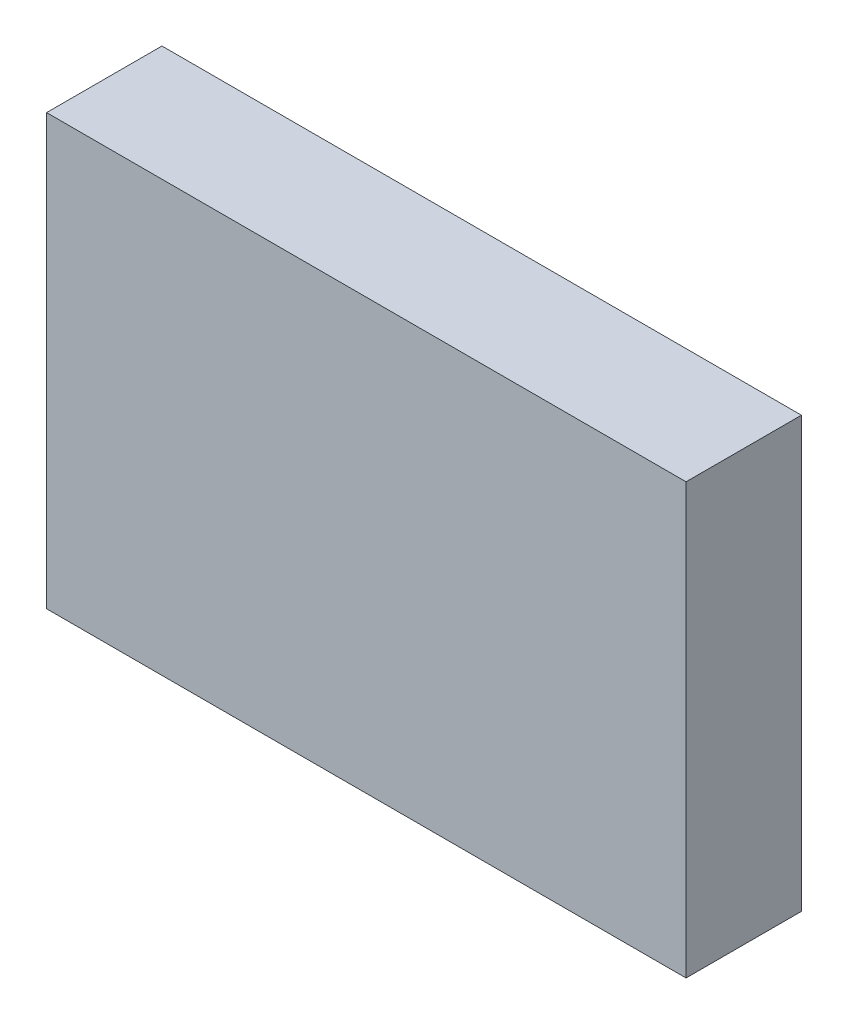
ISO-10303-21;
HEADER;
FILE_DESCRIPTION(('STEP AP214'),'2;1');
FILE_NAME('part.step','',(''),(''),'','','');
FILE_SCHEMA(('AUTOMOTIVE_DESIGN { 1 0 10303 214 1 1 1 1 }'));
ENDSEC;
DATA;
#1=APPLICATION_CONTEXT('core data for automotive mechanical design processes');
#2=APPLICATION_PROTOCOL_DEFINITION('international standard','automotive_design',2000,#1);
#3=PRODUCT_CONTEXT('',#1,'mechanical');
#4=PRODUCT('Part','Part','',(#3));
#5=PRODUCT_RELATED_PRODUCT_CATEGORY('part','',(#4));
#6=PRODUCT_DEFINITION_FORMATION('','',#4);
#7=PRODUCT_DEFINITION_CONTEXT('part definition',#1,'design');
#8=PRODUCT_DEFINITION('design','',#6,#7);
#9=PRODUCT_DEFINITION_SHAPE('','',#8);
#10=(LENGTH_UNIT() NAMED_UNIT(*) SI_UNIT(.MILLI.,.METRE.));
#11=(NAMED_UNIT(*) PLANE_ANGLE_UNIT() SI_UNIT($,.RADIAN.));
#12=(NAMED_UNIT(*) SI_UNIT($,.STERADIAN.) SOLID_ANGLE_UNIT());
#13=UNCERTAINTY_MEASURE_WITH_UNIT(LENGTH_MEASURE(1.E-05),#10,'distance_accuracy_value','');
#14=(GEOMETRIC_REPRESENTATION_CONTEXT(3) GLOBAL_UNCERTAINTY_ASSIGNED_CONTEXT((#13)) GLOBAL_UNIT_ASSIGNED_CONTEXT((#10,
#11,#12)) REPRESENTATION_CONTEXT('',''));
#15=CARTESIAN_POINT('',(0.,0.,0.));
#16=DIRECTION('',(0.,0.,1.));
#17=DIRECTION('',(1.,0.,0.));
#18=AXIS2_PLACEMENT_3D('',#15,#16,#17);
#19=CARTESIAN_POINT('',(-1.52449276,-1.02449122,0.5499989));
#20=DIRECTION('',(0.,0.,1.));
#21=DIRECTION('',(1.,0.,0.));
#22=AXIS2_PLACEMENT_3D('',#19,#20,#21);
#23=PLANE('',#22);
#24=DIRECTION('',(1.,0.,0.));
#25=VECTOR('',#24,1.);
#26=CARTESIAN_POINT('',(-1.52449276,1.02449122,0.5499989));
#27=LINE('',#26,#25);
#28=CARTESIAN_POINT('',(-1.52449276,1.02449122,0.5499989));
#29=VERTEX_POINT('',#28);
#30=CARTESIAN_POINT('',(1.52449276,1.02449122,0.5499989));
#31=VERTEX_POINT('',#30);
#32=EDGE_CURVE('E53',#29,#31,#27,.T.);
#33=ORIENTED_EDGE('',*,*,#32,.F.);
#34=DIRECTION('',(0.,1.,0.));
#35=VECTOR('',#34,1.);
#36=CARTESIAN_POINT('',(-1.52449276,-1.02449122,0.5499989));
#37=LINE('',#36,#35);
#38=CARTESIAN_POINT('',(-1.52449276,-1.02449122,0.5499989));
#39=VERTEX_POINT('',#38);
#40=EDGE_CURVE('E68',#39,#29,#37,.T.);
#41=ORIENTED_EDGE('',*,*,#40,.F.);
#42=DIRECTION('',(1.,0.,0.));
#43=VECTOR('',#42,1.);
#44=CARTESIAN_POINT('',(1.52449276,-1.02449122,0.5499989));
#45=LINE('',#44,#43);
#46=CARTESIAN_POINT('',(1.52449276,-1.02449122,0.5499989));
#47=VERTEX_POINT('',#46);
#48=EDGE_CURVE('E20',#47,#39,#45,.F.);
#49=ORIENTED_EDGE('',*,*,#48,.F.);
#50=DIRECTION('',(0.,1.,0.));
#51=VECTOR('',#50,1.);
#52=CARTESIAN_POINT('',(1.52449276,1.02449122,0.5499989));
#53=LINE('',#52,#51);
#54=EDGE_CURVE('E58',#31,#47,#53,.F.);
#55=ORIENTED_EDGE('',*,*,#54,.F.);
#56=EDGE_LOOP('',(#33,#41,#49,#55));
#57=FACE_BOUND('',#56,.T.);
#58=ADVANCED_FACE('F17',(#57),#23,.T.);
#59=CARTESIAN_POINT('',(1.52449276,-1.02449122,0.));
#60=DIRECTION('',(0.,-1.,0.));
#61=DIRECTION('',(0.,0.,-1.));
#62=AXIS2_PLACEMENT_3D('',#59,#60,#61);
#63=PLANE('',#62);
#64=DIRECTION('',(0.,0.,1.));
#65=VECTOR('',#64,1.);
#66=CARTESIAN_POINT('',(-1.52449276,-1.02449122,0.));
#67=LINE('',#66,#65);
#68=CARTESIAN_POINT('',(-1.52449276,-1.02449122,0.));
#69=VERTEX_POINT('',#68);
#70=EDGE_CURVE('E79',#69,#39,#67,.T.);
#71=ORIENTED_EDGE('',*,*,#70,.F.);
#72=DIRECTION('',(1.,0.,0.));
#73=VECTOR('',#72,1.);
#74=CARTESIAN_POINT('',(-1.52449276,-1.02449122,0.));
#75=LINE('',#74,#73);
#76=CARTESIAN_POINT('',(1.52449276,-1.02449122,0.));
#77=VERTEX_POINT('',#76);
#78=EDGE_CURVE('E74',#69,#77,#75,.T.);
#79=ORIENTED_EDGE('',*,*,#78,.T.);
#80=DIRECTION('',(0.,0.,-1.));
#81=VECTOR('',#80,1.);
#82=CARTESIAN_POINT('',(1.52449276,-1.02449122,0.));
#83=LINE('',#82,#81);
#84=EDGE_CURVE('E63',#47,#77,#83,.T.);
#85=ORIENTED_EDGE('',*,*,#84,.F.);
#86=ORIENTED_EDGE('',*,*,#48,.T.);
#87=EDGE_LOOP('',(#71,#79,#85,#86));
#88=FACE_BOUND('',#87,.T.);
#89=ADVANCED_FACE('F73',(#88),#63,.T.);
#90=CARTESIAN_POINT('',(1.52449276,1.02449122,0.));
#91=DIRECTION('',(1.,0.,0.));
#92=DIRECTION('',(0.,0.,-1.));
#93=AXIS2_PLACEMENT_3D('',#90,#91,#92);
#94=PLANE('',#93);
#95=ORIENTED_EDGE('',*,*,#84,.T.);
#96=DIRECTION('',(0.,1.,0.));
#97=VECTOR('',#96,1.);
#98=CARTESIAN_POINT('',(1.52449276,-1.02449122,0.));
#99=LINE('',#98,#97);
#100=CARTESIAN_POINT('',(1.52449276,1.02449122,0.));
#101=VERTEX_POINT('',#100);
#102=EDGE_CURVE('E84',#77,#101,#99,.T.);
#103=ORIENTED_EDGE('',*,*,#102,.T.);
#104=DIRECTION('',(0.,0.,1.));
#105=VECTOR('',#104,1.);
#106=CARTESIAN_POINT('',(1.52449276,1.02449122,0.));
#107=LINE('',#106,#105);
#108=EDGE_CURVE('E65',#31,#101,#107,.F.);
#109=ORIENTED_EDGE('',*,*,#108,.F.);
#110=ORIENTED_EDGE('',*,*,#54,.T.);
#111=EDGE_LOOP('',(#95,#103,#109,#110));
#112=FACE_BOUND('',#111,.T.);
#113=ADVANCED_FACE('F60',(#112),#94,.T.);
#114=CARTESIAN_POINT('',(-1.52449276,1.02449122,0.));
#115=DIRECTION('',(0.,1.,0.));
#116=DIRECTION('',(0.,0.,1.));
#117=AXIS2_PLACEMENT_3D('',#114,#115,#116);
#118=PLANE('',#117);
#119=ORIENTED_EDGE('',*,*,#108,.T.);
#120=DIRECTION('',(1.,0.,0.));
#121=VECTOR('',#120,1.);
#122=CARTESIAN_POINT('',(-1.52449276,1.02449122,0.));
#123=LINE('',#122,#121);
#124=CARTESIAN_POINT('',(-1.52449276,1.02449122,0.));
#125=VERTEX_POINT('',#124);
#126=EDGE_CURVE('E26',#101,#125,#123,.F.);
#127=ORIENTED_EDGE('',*,*,#126,.T.);
#128=DIRECTION('',(0.,0.,1.));
#129=VECTOR('',#128,1.);
#130=CARTESIAN_POINT('',(-1.52449276,1.02449122,0.));
#131=LINE('',#130,#129);
#132=EDGE_CURVE('E34',#29,#125,#131,.F.);
#133=ORIENTED_EDGE('',*,*,#132,.F.);
#134=ORIENTED_EDGE('',*,*,#32,.T.);
#135=EDGE_LOOP('',(#119,#127,#133,#134));
#136=FACE_BOUND('',#135,.T.);
#137=ADVANCED_FACE('F88',(#136),#118,.T.);
#138=CARTESIAN_POINT('',(-1.52449276,-1.02449122,0.));
#139=DIRECTION('',(-1.,0.,0.));
#140=DIRECTION('',(0.,0.,1.));
#141=AXIS2_PLACEMENT_3D('',#138,#139,#140);
#142=PLANE('',#141);
#143=ORIENTED_EDGE('',*,*,#132,.T.);
#144=DIRECTION('',(0.,1.,0.));
#145=VECTOR('',#144,1.);
#146=CARTESIAN_POINT('',(-1.52449276,-1.02449122,0.));
#147=LINE('',#146,#145);
#148=EDGE_CURVE('E11',#125,#69,#147,.F.);
#149=ORIENTED_EDGE('',*,*,#148,.T.);
#150=ORIENTED_EDGE('',*,*,#70,.T.);
#151=ORIENTED_EDGE('',*,*,#40,.T.);
#152=EDGE_LOOP('',(#143,#149,#150,#151));
#153=FACE_BOUND('',#152,.T.);
#154=ADVANCED_FACE('F91',(#153),#142,.T.);
#155=CARTESIAN_POINT('',(-1.52449276,-1.02449122,0.));
#156=DIRECTION('',(0.,0.,1.));
#157=DIRECTION('',(1.,0.,0.));
#158=AXIS2_PLACEMENT_3D('',#155,#156,#157);
#159=PLANE('',#158);
#160=ORIENTED_EDGE('',*,*,#126,.F.);
#161=ORIENTED_EDGE('',*,*,#102,.F.);
#162=ORIENTED_EDGE('',*,*,#78,.F.);
#163=ORIENTED_EDGE('',*,*,#148,.F.);
#164=EDGE_LOOP('',(#160,#161,#162,#163));
#165=FACE_BOUND('',#164,.T.);
#166=ADVANCED_FACE('F90',(#165),#159,.F.);
#167=CLOSED_SHELL('',(#58,#89,#113,#137,#154,#166));
#168=MANIFOLD_SOLID_BREP('B1',#167);
#169=ADVANCED_BREP_SHAPE_REPRESENTATION('',(#18,#168),#14);
#170=SHAPE_DEFINITION_REPRESENTATION(#9,#169);
ENDSEC;
END-ISO-10303-21;
